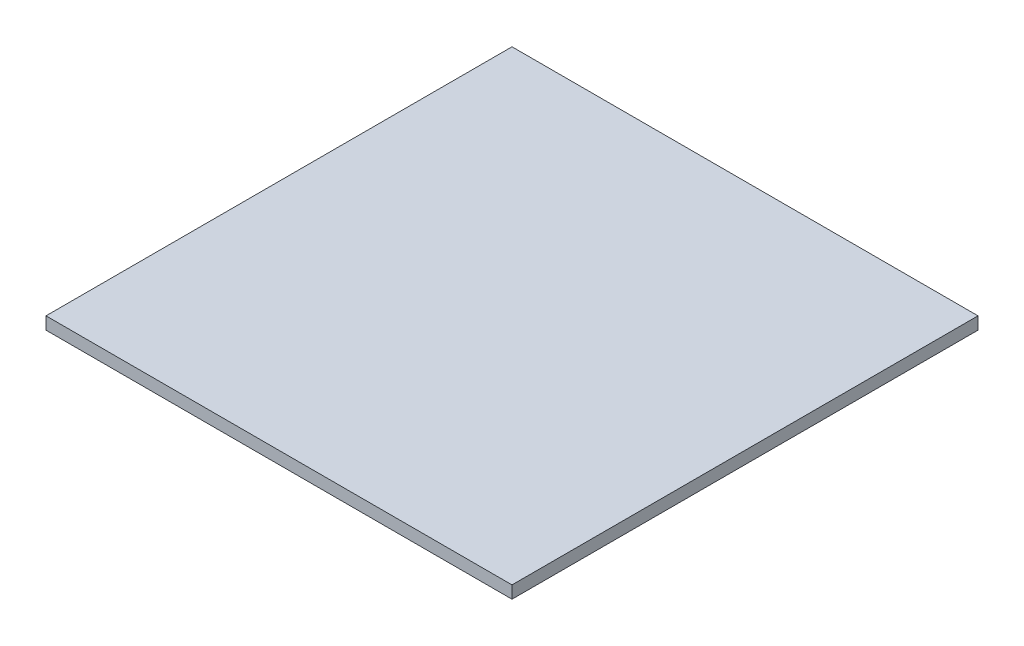
ISO-10303-21;
HEADER;
FILE_DESCRIPTION(('STEP AP214'),'2;1');
FILE_NAME('part.step','',(''),(''),'','','');
FILE_SCHEMA(('AUTOMOTIVE_DESIGN { 1 0 10303 214 1 1 1 1 }'));
ENDSEC;
DATA;
#1=APPLICATION_CONTEXT('core data for automotive mechanical design processes');
#2=APPLICATION_PROTOCOL_DEFINITION('international standard','automotive_design',2000,#1);
#3=PRODUCT_CONTEXT('',#1,'mechanical');
#4=PRODUCT('Part','Part','',(#3));
#5=PRODUCT_RELATED_PRODUCT_CATEGORY('part','',(#4));
#6=PRODUCT_DEFINITION_FORMATION('','',#4);
#7=PRODUCT_DEFINITION_CONTEXT('part definition',#1,'design');
#8=PRODUCT_DEFINITION('design','',#6,#7);
#9=PRODUCT_DEFINITION_SHAPE('','',#8);
#10=(LENGTH_UNIT() NAMED_UNIT(*) SI_UNIT(.MILLI.,.METRE.));
#11=(NAMED_UNIT(*) PLANE_ANGLE_UNIT() SI_UNIT($,.RADIAN.));
#12=(NAMED_UNIT(*) SI_UNIT($,.STERADIAN.) SOLID_ANGLE_UNIT());
#13=UNCERTAINTY_MEASURE_WITH_UNIT(LENGTH_MEASURE(1.E-05),#10,'distance_accuracy_value','');
#14=(GEOMETRIC_REPRESENTATION_CONTEXT(3) GLOBAL_UNCERTAINTY_ASSIGNED_CONTEXT((#13)) GLOBAL_UNIT_ASSIGNED_CONTEXT((#10,
#11,#12)) REPRESENTATION_CONTEXT('',''));
#15=CARTESIAN_POINT('',(0.,0.,0.));
#16=DIRECTION('',(0.,0.,1.));
#17=DIRECTION('',(1.,0.,0.));
#18=AXIS2_PLACEMENT_3D('',#15,#16,#17);
#19=CARTESIAN_POINT('',(0.,4.,0.));
#20=DIRECTION('',(1.,0.,0.));
#21=DIRECTION('',(0.,0.,-1.));
#22=AXIS2_PLACEMENT_3D('',#19,#20,#21);
#23=PLANE('',#22);
#24=DIRECTION('',(0.,0.,1.));
#25=VECTOR('',#24,1.);
#26=CARTESIAN_POINT('',(0.,0.,0.));
#27=LINE('',#26,#25);
#28=CARTESIAN_POINT('',(0.,0.,-150.));
#29=VERTEX_POINT('',#28);
#30=CARTESIAN_POINT('',(0.,0.,0.));
#31=VERTEX_POINT('',#30);
#32=EDGE_CURVE('E109',#29,#31,#27,.T.);
#33=ORIENTED_EDGE('',*,*,#32,.T.);
#34=DIRECTION('',(0.,-1.,0.));
#35=VECTOR('',#34,1.);
#36=CARTESIAN_POINT('',(0.,4.,0.));
#37=LINE('',#36,#35);
#38=CARTESIAN_POINT('',(0.,4.,0.));
#39=VERTEX_POINT('',#38);
#40=EDGE_CURVE('E11',#39,#31,#37,.T.);
#41=ORIENTED_EDGE('',*,*,#40,.F.);
#42=DIRECTION('',(0.,0.,1.));
#43=VECTOR('',#42,1.);
#44=CARTESIAN_POINT('',(0.,4.,0.));
#45=LINE('',#44,#43);
#46=CARTESIAN_POINT('',(0.,4.,-150.));
#47=VERTEX_POINT('',#46);
#48=EDGE_CURVE('E93',#47,#39,#45,.T.);
#49=ORIENTED_EDGE('',*,*,#48,.F.);
#50=DIRECTION('',(0.,-1.,0.));
#51=VECTOR('',#50,1.);
#52=CARTESIAN_POINT('',(0.,4.,-150.));
#53=LINE('',#52,#51);
#54=EDGE_CURVE('E105',#47,#29,#53,.T.);
#55=ORIENTED_EDGE('',*,*,#54,.T.);
#56=EDGE_LOOP('',(#33,#41,#49,#55));
#57=FACE_BOUND('',#56,.T.);
#58=ADVANCED_FACE('F41',(#57),#23,.F.);
#59=CARTESIAN_POINT('',(0.,4.,0.));
#60=DIRECTION('',(0.,0.,-1.));
#61=DIRECTION('',(-1.,0.,0.));
#62=AXIS2_PLACEMENT_3D('',#59,#60,#61);
#63=PLANE('',#62);
#64=DIRECTION('',(1.,0.,0.));
#65=VECTOR('',#64,1.);
#66=CARTESIAN_POINT('',(0.,0.,0.));
#67=LINE('',#66,#65);
#68=CARTESIAN_POINT('',(150.,0.,0.));
#69=VERTEX_POINT('',#68);
#70=EDGE_CURVE('E98',#31,#69,#67,.T.);
#71=ORIENTED_EDGE('',*,*,#70,.T.);
#72=DIRECTION('',(0.,-1.,0.));
#73=VECTOR('',#72,1.);
#74=CARTESIAN_POINT('',(150.,4.,0.));
#75=LINE('',#74,#73);
#76=CARTESIAN_POINT('',(150.,4.,0.));
#77=VERTEX_POINT('',#76);
#78=EDGE_CURVE('E50',#77,#69,#75,.T.);
#79=ORIENTED_EDGE('',*,*,#78,.F.);
#80=DIRECTION('',(1.,0.,0.));
#81=VECTOR('',#80,1.);
#82=CARTESIAN_POINT('',(0.,4.,0.));
#83=LINE('',#82,#81);
#84=EDGE_CURVE('E88',#39,#77,#83,.T.);
#85=ORIENTED_EDGE('',*,*,#84,.F.);
#86=ORIENTED_EDGE('',*,*,#40,.T.);
#87=EDGE_LOOP('',(#71,#79,#85,#86));
#88=FACE_BOUND('',#87,.T.);
#89=ADVANCED_FACE('F97',(#88),#63,.F.);
#90=CARTESIAN_POINT('',(150.,4.,0.));
#91=DIRECTION('',(-1.,0.,0.));
#92=DIRECTION('',(0.,0.,1.));
#93=AXIS2_PLACEMENT_3D('',#90,#91,#92);
#94=PLANE('',#93);
#95=DIRECTION('',(0.,0.,-1.));
#96=VECTOR('',#95,1.);
#97=CARTESIAN_POINT('',(150.,0.,0.));
#98=LINE('',#97,#96);
#99=CARTESIAN_POINT('',(150.,0.,-150.));
#100=VERTEX_POINT('',#99);
#101=EDGE_CURVE('E75',#69,#100,#98,.T.);
#102=ORIENTED_EDGE('',*,*,#101,.T.);
#103=DIRECTION('',(0.,-1.,0.));
#104=VECTOR('',#103,1.);
#105=CARTESIAN_POINT('',(150.,4.,-150.));
#106=LINE('',#105,#104);
#107=CARTESIAN_POINT('',(150.,4.,-150.));
#108=VERTEX_POINT('',#107);
#109=EDGE_CURVE('E100',#108,#100,#106,.T.);
#110=ORIENTED_EDGE('',*,*,#109,.F.);
#111=DIRECTION('',(0.,0.,-1.));
#112=VECTOR('',#111,1.);
#113=CARTESIAN_POINT('',(150.,4.,0.));
#114=LINE('',#113,#112);
#115=EDGE_CURVE('E91',#77,#108,#114,.T.);
#116=ORIENTED_EDGE('',*,*,#115,.F.);
#117=ORIENTED_EDGE('',*,*,#78,.T.);
#118=EDGE_LOOP('',(#102,#110,#116,#117));
#119=FACE_BOUND('',#118,.T.);
#120=ADVANCED_FACE('F101',(#119),#94,.F.);
#121=CARTESIAN_POINT('',(0.,4.,-150.));
#122=DIRECTION('',(0.,0.,1.));
#123=DIRECTION('',(1.,0.,0.));
#124=AXIS2_PLACEMENT_3D('',#121,#122,#123);
#125=PLANE('',#124);
#126=DIRECTION('',(-1.,0.,0.));
#127=VECTOR('',#126,1.);
#128=CARTESIAN_POINT('',(0.,0.,-150.));
#129=LINE('',#128,#127);
#130=EDGE_CURVE('E81',#100,#29,#129,.T.);
#131=ORIENTED_EDGE('',*,*,#130,.T.);
#132=ORIENTED_EDGE('',*,*,#54,.F.);
#133=DIRECTION('',(-1.,0.,0.));
#134=VECTOR('',#133,1.);
#135=CARTESIAN_POINT('',(0.,4.,-150.));
#136=LINE('',#135,#134);
#137=EDGE_CURVE('E58',#108,#47,#136,.T.);
#138=ORIENTED_EDGE('',*,*,#137,.F.);
#139=ORIENTED_EDGE('',*,*,#109,.T.);
#140=EDGE_LOOP('',(#131,#132,#138,#139));
#141=FACE_BOUND('',#140,.T.);
#142=ADVANCED_FACE('F122',(#141),#125,.F.);
#143=CARTESIAN_POINT('',(0.,4.,0.));
#144=DIRECTION('',(0.,-1.,0.));
#145=DIRECTION('',(0.,0.,-1.));
#146=AXIS2_PLACEMENT_3D('',#143,#144,#145);
#147=PLANE('',#146);
#148=ORIENTED_EDGE('',*,*,#48,.T.);
#149=ORIENTED_EDGE('',*,*,#84,.T.);
#150=ORIENTED_EDGE('',*,*,#115,.T.);
#151=ORIENTED_EDGE('',*,*,#137,.T.);
#152=EDGE_LOOP('',(#148,#149,#150,#151));
#153=FACE_BOUND('',#152,.T.);
#154=ADVANCED_FACE('F89',(#153),#147,.F.);
#155=CARTESIAN_POINT('',(0.,0.,0.));
#156=DIRECTION('',(0.,-1.,0.));
#157=DIRECTION('',(0.,0.,-1.));
#158=AXIS2_PLACEMENT_3D('',#155,#156,#157);
#159=PLANE('',#158);
#160=ORIENTED_EDGE('',*,*,#32,.F.);
#161=ORIENTED_EDGE('',*,*,#130,.F.);
#162=ORIENTED_EDGE('',*,*,#101,.F.);
#163=ORIENTED_EDGE('',*,*,#70,.F.);
#164=EDGE_LOOP('',(#160,#161,#162,#163));
#165=FACE_BOUND('',#164,.T.);
#166=ADVANCED_FACE('F125',(#165),#159,.T.);
#167=CLOSED_SHELL('',(#58,#89,#120,#142,#154,#166));
#168=MANIFOLD_SOLID_BREP('B2',#167);
#169=ADVANCED_BREP_SHAPE_REPRESENTATION('',(#18,#168),#14);
#170=SHAPE_DEFINITION_REPRESENTATION(#9,#169);
ENDSEC;
END-ISO-10303-21;
